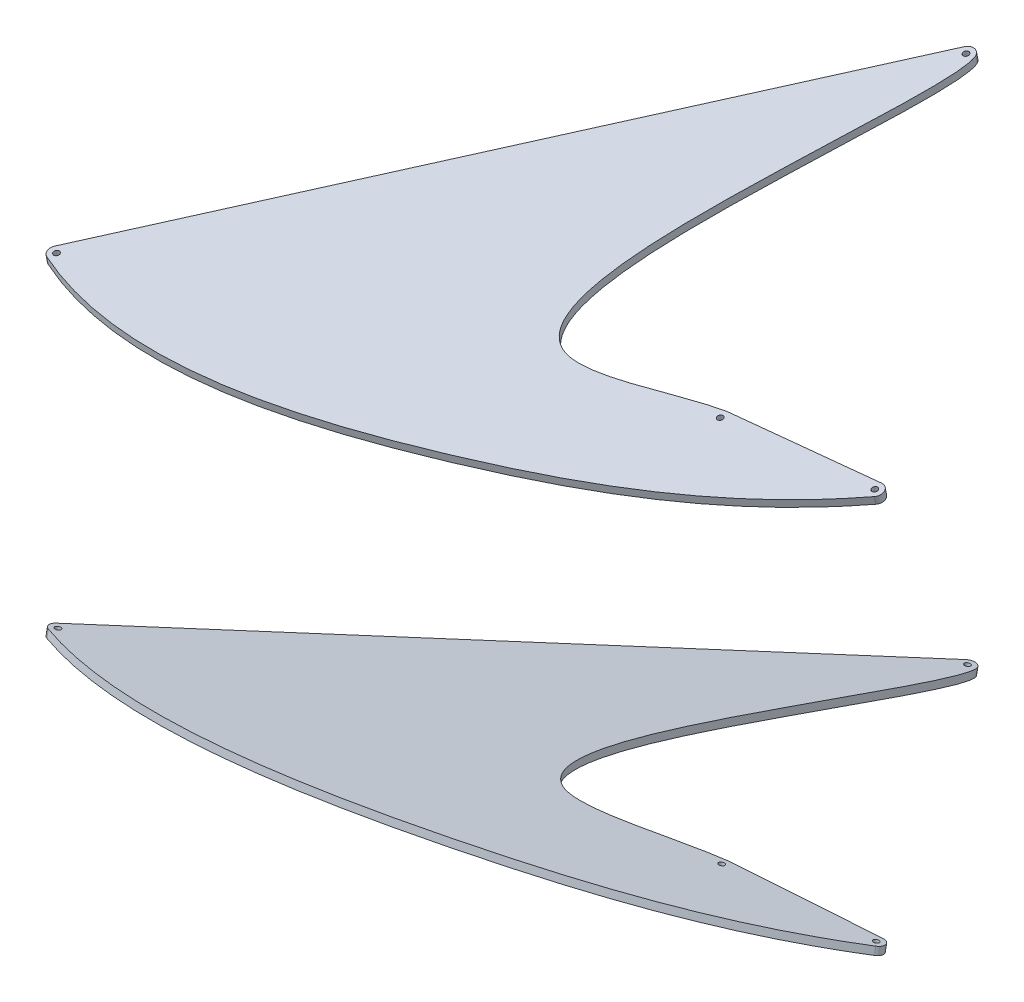
ISO-10303-21;
HEADER;
FILE_DESCRIPTION(('STEP AP214'),'2;1');
FILE_NAME('part.step','',(''),(''),'','','');
FILE_SCHEMA(('AUTOMOTIVE_DESIGN { 1 0 10303 214 1 1 1 1 }'));
ENDSEC;
DATA;
#1=APPLICATION_CONTEXT('core data for automotive mechanical design processes');
#2=APPLICATION_PROTOCOL_DEFINITION('international standard','automotive_design',2000,#1);
#3=PRODUCT_CONTEXT('',#1,'mechanical');
#4=PRODUCT('Part','Part','',(#3));
#5=PRODUCT_RELATED_PRODUCT_CATEGORY('part','',(#4));
#6=PRODUCT_DEFINITION_FORMATION('','',#4);
#7=PRODUCT_DEFINITION_CONTEXT('part definition',#1,'design');
#8=PRODUCT_DEFINITION('design','',#6,#7);
#9=PRODUCT_DEFINITION_SHAPE('','',#8);
#10=(LENGTH_UNIT() NAMED_UNIT(*) SI_UNIT(.MILLI.,.METRE.));
#11=(NAMED_UNIT(*) PLANE_ANGLE_UNIT() SI_UNIT($,.RADIAN.));
#12=(NAMED_UNIT(*) SI_UNIT($,.STERADIAN.) SOLID_ANGLE_UNIT());
#13=UNCERTAINTY_MEASURE_WITH_UNIT(LENGTH_MEASURE(1.E-05),#10,'distance_accuracy_value','');
#14=(GEOMETRIC_REPRESENTATION_CONTEXT(3) GLOBAL_UNCERTAINTY_ASSIGNED_CONTEXT((#13)) GLOBAL_UNIT_ASSIGNED_CONTEXT((#10,
#11,#12)) REPRESENTATION_CONTEXT('',''));
#15=CARTESIAN_POINT('',(0.,0.,0.));
#16=DIRECTION('',(0.,0.,1.));
#17=DIRECTION('',(1.,0.,0.));
#18=AXIS2_PLACEMENT_3D('',#15,#16,#17);
#19=CARTESIAN_POINT('',(85.8023522939303,179.336112250859,989.228940078294));
#20=DIRECTION('',(0.0912057377738218,-0.190013717008725,0.977535830926755));
#21=DIRECTION('',(0.,0.981627183447666,0.190808995376532));
#22=AXIS2_PLACEMENT_3D('',#19,#20,#21);
#23=PLANE('',#22);
#24=DIRECTION('',(-0.995832070882,-0.0174028751971982,0.0895300314851831));
#25=VECTOR('',#24,1.);
#26=CARTESIAN_POINT('',(85.8023522939303,187.18912971844,990.755412041306));
#27=LINE('',#26,#25);
#28=CARTESIAN_POINT('',(1634.87159887673,214.260218869266,851.486731633723));
#29=VERTEX_POINT('',#28);
#30=CARTESIAN_POINT('',(1483.17373169951,211.609190520854,865.12509017));
#31=VERTEX_POINT('',#30);
#32=EDGE_CURVE('E209',#29,#31,#27,.T.);
#33=ORIENTED_EDGE('',*,*,#32,.F.);
#34=DIRECTION('',(0.,0.981627183447666,0.190808995376532));
#35=VECTOR('',#34,1.);
#36=CARTESIAN_POINT('',(1634.87159887673,206.407201401685,849.960259670711));
#37=LINE('',#36,#35);
#38=CARTESIAN_POINT('',(1634.87159887673,206.407201401685,849.960259670711));
#39=VERTEX_POINT('',#38);
#40=EDGE_CURVE('E189',#39,#29,#37,.T.);
#41=ORIENTED_EDGE('',*,*,#40,.F.);
#42=DIRECTION('',(-0.995832070882,-0.0174028751971982,0.0895300314851831));
#43=VECTOR('',#42,1.);
#44=CARTESIAN_POINT('',(85.8023522939303,179.336112250859,989.228940078294));
#45=LINE('',#44,#43);
#46=CARTESIAN_POINT('',(1483.17373169951,203.756173053273,863.598618206988));
#47=VERTEX_POINT('',#46);
#48=EDGE_CURVE('E171',#39,#47,#45,.T.);
#49=ORIENTED_EDGE('',*,*,#48,.T.);
#50=DIRECTION('',(0.,0.981627183447666,0.190808995376532));
#51=VECTOR('',#50,1.);
#52=CARTESIAN_POINT('',(1483.17373169951,203.756173053273,863.598618206988));
#53=LINE('',#52,#51);
#54=EDGE_CURVE('E12',#47,#31,#53,.T.);
#55=ORIENTED_EDGE('',*,*,#54,.T.);
#56=EDGE_LOOP('',(#33,#41,#49,#55));
#57=FACE_BOUND('',#56,.T.);
#58=ADVANCED_FACE('F48',(#57),#23,.F.);
#59=CARTESIAN_POINT('',(1483.17373169951,203.756173053273,863.598618206988));
#60=CARTESIAN_POINT('',(1437.46975431813,202.285143875733,871.166407269909));
#61=CARTESIAN_POINT('',(1275.87917955866,188.154373527801,943.862918612124));
#62=CARTESIAN_POINT('',(1317.91374916909,239.794313006558,678.198460582201));
#63=CARTESIAN_POINT('',(1370.507425365,275.318540911062,495.442151251829));
#64=CARTESIAN_POINT('',(1362.28362897459,278.802568058359,477.51838539945));
#65=B_SPLINE_CURVE_WITH_KNOTS('',3,(#59,#60,#61,#62,#63,#64),.UNSPECIFIED.,.F.,.F.,(4,1,1,4),
(0.,0.258279360995668,0.641643028025611,1.),.UNSPECIFIED.);
#66=DIRECTION('',(0.,0.981627183447666,0.190808995376532));
#67=VECTOR('',#66,1.);
#68=SURFACE_OF_LINEAR_EXTRUSION('',#65,#67);
#69=CARTESIAN_POINT('',(1483.17373169951,211.609190520854,865.12509017));
#70=CARTESIAN_POINT('',(1437.46975431813,210.138161343315,872.692879232921));
#71=CARTESIAN_POINT('',(1275.87917955866,196.007390995382,945.389390575136));
#72=CARTESIAN_POINT('',(1317.91374916909,247.647330474139,679.724932545213));
#73=CARTESIAN_POINT('',(1370.507425365,283.171558378643,496.968623214842));
#74=CARTESIAN_POINT('',(1362.28362897459,286.65558552594,479.044857362463));
#75=B_SPLINE_CURVE_WITH_KNOTS('',3,(#69,#70,#71,#72,#73,#74),.UNSPECIFIED.,.F.,.F.,(4,1,1,4),
(0.,0.258279360995668,0.641643028025611,1.),.UNSPECIFIED.);
#76=CARTESIAN_POINT('',(1362.28362897459,286.65558552594,479.044857362463));
#77=VERTEX_POINT('',#76);
#78=EDGE_CURVE('E204',#31,#77,#75,.T.);
#79=ORIENTED_EDGE('',*,*,#78,.F.);
#80=ORIENTED_EDGE('',*,*,#54,.F.);
#81=CARTESIAN_POINT('',(1362.28362897459,278.802568058359,477.518385399451));
#82=VERTEX_POINT('',#81);
#83=EDGE_CURVE('E100',#47,#82,#65,.T.);
#84=ORIENTED_EDGE('',*,*,#83,.T.);
#85=DIRECTION('',(0.,0.981627183447666,0.190808995376532));
#86=VECTOR('',#85,1.);
#87=CARTESIAN_POINT('',(1362.28362897459,278.802568058359,477.518385399451));
#88=LINE('',#87,#86);
#89=EDGE_CURVE('E57',#82,#77,#88,.T.);
#90=ORIENTED_EDGE('',*,*,#89,.T.);
#91=EDGE_LOOP('',(#79,#80,#84,#90));
#92=FACE_BOUND('',#91,.T.);
#93=ADVANCED_FACE('F160',(#92),#68,.T.);
#94=CARTESIAN_POINT('',(1354.98932451009,278.175705406399,480.743314173053));
#95=DIRECTION('',(0.,0.981627183447666,0.190808995376532));
#96=DIRECTION('',(0.,0.190808995376532,-0.981627183447667));
#97=AXIS2_PLACEMENT_3D('',#94,#95,#96);
#98=CYLINDRICAL_SURFACE('',#97,7.99999999999995);
#99=CARTESIAN_POINT('',(1354.98932451009,286.02872287398,482.269786136065));
#100=DIRECTION('',(0.,0.981627183447667,0.190808995376532));
#101=DIRECTION('',(0.,-0.190808995376532,0.981627183447667));
#102=AXIS2_PLACEMENT_3D('',#99,#100,#101);
#103=CIRCLE('',#102,7.99999999999995);
#104=CARTESIAN_POINT('',(1348.4904984298,286.918908895785,477.690176062627));
#105=VERTEX_POINT('',#104);
#106=EDGE_CURVE('E202',#77,#105,#103,.T.);
#107=ORIENTED_EDGE('',*,*,#106,.F.);
#108=ORIENTED_EDGE('',*,*,#89,.F.);
#109=CARTESIAN_POINT('',(1354.98932451009,278.175705406399,480.743314173053));
#110=DIRECTION('',(0.,0.981627183447667,0.190808995376532));
#111=DIRECTION('',(0.,-0.190808995376532,0.981627183447667));
#112=AXIS2_PLACEMENT_3D('',#109,#110,#111);
#113=CIRCLE('',#112,7.99999999999995);
#114=CARTESIAN_POINT('',(1348.4904984298,279.065891428204,476.163704099615));
#115=VERTEX_POINT('',#114);
#116=EDGE_CURVE('E133',#82,#115,#113,.T.);
#117=ORIENTED_EDGE('',*,*,#116,.T.);
#118=DIRECTION('',(0.,0.981627183447666,0.190808995376532));
#119=VECTOR('',#118,1.);
#120=CARTESIAN_POINT('',(1348.4904984298,279.065891428204,476.163704099615));
#121=LINE('',#120,#119);
#122=EDGE_CURVE('E180',#115,#105,#121,.T.);
#123=ORIENTED_EDGE('',*,*,#122,.T.);
#124=EDGE_LOOP('',(#107,#108,#117,#123));
#125=FACE_BOUND('',#124,.T.);
#126=ADVANCED_FACE('F156',(#125),#98,.T.);
#127=CARTESIAN_POINT('',(1086.098920288,209.322714615042,834.96124446032));
#128=DIRECTION('',(-0.812353260036138,0.111273252725634,-0.572451259179781));
#129=DIRECTION('',(-0.576028483257774,0.,0.81742962172639));
#130=AXIS2_PLACEMENT_3D('',#127,#128,#129);
#131=PLANE('',#130);
#132=DIRECTION('',(0.583165654774576,0.155004309438346,-0.797428042613803));
#133=VECTOR('',#132,1.);
#134=CARTESIAN_POINT('',(1086.098920288,217.175732082623,836.487716423332));
#135=LINE('',#134,#133);
#136=CARTESIAN_POINT('',(939.371284339955,178.175808648449,1037.12492914916));
#137=VERTEX_POINT('',#136);
#138=EDGE_CURVE('E184',#137,#105,#135,.T.);
#139=ORIENTED_EDGE('',*,*,#138,.T.);
#140=ORIENTED_EDGE('',*,*,#122,.F.);
#141=DIRECTION('',(0.583165654774576,0.155004309438346,-0.797428042613803));
#142=VECTOR('',#141,1.);
#143=CARTESIAN_POINT('',(1086.098920288,209.322714615042,834.96124446032));
#144=LINE('',#143,#142);
#145=CARTESIAN_POINT('',(939.371284339955,170.322791180868,1035.59845718615));
#146=VERTEX_POINT('',#145);
#147=EDGE_CURVE('E131',#146,#115,#144,.T.);
#148=ORIENTED_EDGE('',*,*,#147,.F.);
#149=DIRECTION('',(0.,0.981627183447666,0.190808995376532));
#150=VECTOR('',#149,1.);
#151=CARTESIAN_POINT('',(939.371284339955,170.322791180868,1035.59845718615));
#152=LINE('',#151,#150);
#153=EDGE_CURVE('E125',#146,#137,#152,.T.);
#154=ORIENTED_EDGE('',*,*,#153,.T.);
#155=EDGE_LOOP('',(#139,#140,#148,#154));
#156=FACE_BOUND('',#155,.T.);
#157=ADVANCED_FACE('F153',(#156),#131,.T.);
#158=CARTESIAN_POINT('',(945.870110420244,169.432605159063,1040.17806725959));
#159=DIRECTION('',(0.,0.981627183447666,0.190808995376532));
#160=DIRECTION('',(0.,0.190808995376532,-0.981627183447667));
#161=AXIS2_PLACEMENT_3D('',#158,#159,#160);
#162=CYLINDRICAL_SURFACE('',#161,7.99999999999995);
#163=CARTESIAN_POINT('',(945.870110420244,177.285622626644,1041.7045392226));
#164=DIRECTION('',(0.,0.981627183447667,0.190808995376532));
#165=DIRECTION('',(0.,-0.190808995376532,0.981627183447667));
#166=AXIS2_PLACEMENT_3D('',#163,#164,#165);
#167=CIRCLE('',#166,7.99999999999995);
#168=CARTESIAN_POINT('',(942.811265429459,175.875139258519,1048.96084709855));
#169=VERTEX_POINT('',#168);
#170=EDGE_CURVE('E196',#137,#169,#167,.T.);
#171=ORIENTED_EDGE('',*,*,#170,.F.);
#172=ORIENTED_EDGE('',*,*,#153,.F.);
#173=CARTESIAN_POINT('',(945.870110420244,169.432605159063,1040.17806725959));
#174=DIRECTION('',(0.,0.981627183447667,0.190808995376532));
#175=DIRECTION('',(0.,-0.190808995376532,0.981627183447667));
#176=AXIS2_PLACEMENT_3D('',#173,#174,#175);
#177=CIRCLE('',#176,7.99999999999995);
#178=CARTESIAN_POINT('',(942.811265429459,168.022121790937,1047.43437513554));
#179=VERTEX_POINT('',#178);
#180=EDGE_CURVE('E115',#146,#179,#177,.T.);
#181=ORIENTED_EDGE('',*,*,#180,.T.);
#182=DIRECTION('',(0.,0.981627183447666,0.190808995376532));
#183=VECTOR('',#182,1.);
#184=CARTESIAN_POINT('',(942.811265429459,168.022121790937,1047.43437513554));
#185=LINE('',#184,#183);
#186=EDGE_CURVE('E120',#179,#169,#185,.T.);
#187=ORIENTED_EDGE('',*,*,#186,.T.);
#188=EDGE_LOOP('',(#171,#172,#181,#187));
#189=FACE_BOUND('',#188,.T.);
#190=ADVANCED_FACE('F128',(#189),#162,.T.);
#191=CARTESIAN_POINT('',(942.811265429459,168.022121790937,1047.43437513554));
#192=CARTESIAN_POINT('',(1065.43063585139,158.340541049026,1097.24179022229));
#193=CARTESIAN_POINT('',(1335.8064137837,170.009935627326,1037.20795948054));
#194=CARTESIAN_POINT('',(1556.49988429373,189.082458388016,939.088335917341));
#195=CARTESIAN_POINT('',(1640.28133100087,203.756173053273,863.598618206988));
#196=B_SPLINE_CURVE_WITH_KNOTS('',3,(#191,#192,#193,#194,#195),.UNSPECIFIED.,.F.,.F.,(4,1,4),
(0.,0.548324658818847,1.),.UNSPECIFIED.);
#197=DIRECTION('',(0.,0.981627183447666,0.190808995376532));
#198=VECTOR('',#197,1.);
#199=SURFACE_OF_LINEAR_EXTRUSION('',#196,#198);
#200=CARTESIAN_POINT('',(942.811265429459,175.875139258519,1048.96084709855));
#201=CARTESIAN_POINT('',(1065.43063585139,166.193558516607,1098.7682621853));
#202=CARTESIAN_POINT('',(1335.8064137837,177.862953094908,1038.73443144355));
#203=CARTESIAN_POINT('',(1556.49988429373,196.935475855598,940.614807880353));
#204=CARTESIAN_POINT('',(1640.28133100087,211.609190520854,865.12509017));
#205=B_SPLINE_CURVE_WITH_KNOTS('',3,(#200,#201,#202,#203,#204),.UNSPECIFIED.,.F.,.F.,(4,1,4),
(0.,0.548324658818847,1.),.UNSPECIFIED.);
#206=CARTESIAN_POINT('',(1640.28133100087,211.609190520854,865.12509017));
#207=VERTEX_POINT('',#206);
#208=EDGE_CURVE('E122',#169,#207,#205,.T.);
#209=ORIENTED_EDGE('',*,*,#208,.F.);
#210=ORIENTED_EDGE('',*,*,#186,.F.);
#211=CARTESIAN_POINT('',(1640.28133100087,203.756173053273,863.598618206988));
#212=VERTEX_POINT('',#211);
#213=EDGE_CURVE('E111',#179,#212,#196,.T.);
#214=ORIENTED_EDGE('',*,*,#213,.T.);
#215=DIRECTION('',(0.,0.981627183447666,0.190808995376532));
#216=VECTOR('',#215,1.);
#217=CARTESIAN_POINT('',(1640.28133100087,203.756173053273,863.598618206988));
#218=LINE('',#217,#216);
#219=EDGE_CURVE('E126',#212,#207,#218,.T.);
#220=ORIENTED_EDGE('',*,*,#219,.T.);
#221=EDGE_LOOP('',(#209,#210,#214,#220));
#222=FACE_BOUND('',#221,.T.);
#223=ADVANCED_FACE('F121',(#222),#199,.T.);
#224=CARTESIAN_POINT('',(1354.98932451009,278.175705406399,480.743314173053));
#225=DIRECTION('',(0.,0.981627183447666,0.190808995376532));
#226=DIRECTION('',(0.,0.190808995376532,-0.981627183447667));
#227=AXIS2_PLACEMENT_3D('',#224,#225,#226);
#228=CYLINDRICAL_SURFACE('',#227,2.99999999999993);
#229=CARTESIAN_POINT('',(1354.98932451009,278.175705406399,480.743314173053));
#230=DIRECTION('',(0.,0.981627183447667,0.190808995376532));
#231=DIRECTION('',(0.,-0.190808995376532,0.981627183447667));
#232=AXIS2_PLACEMENT_3D('',#229,#230,#231);
#233=CIRCLE('',#232,2.99999999999993);
#234=CARTESIAN_POINT('',(1354.98932451009,277.603278420269,483.688195723395));
#235=VERTEX_POINT('',#234);
#236=EDGE_CURVE('E239',#235,#235,#233,.T.);
#237=ORIENTED_EDGE('',*,*,#236,.F.);
#238=EDGE_LOOP('',(#237));
#239=FACE_BOUND('',#238,.T.);
#240=CARTESIAN_POINT('',(1354.98932451009,286.02872287398,482.269786136065));
#241=DIRECTION('',(0.,0.981627183447667,0.190808995376532));
#242=DIRECTION('',(0.,-0.190808995376532,0.981627183447667));
#243=AXIS2_PLACEMENT_3D('',#240,#241,#242);
#244=CIRCLE('',#243,2.99999999999993);
#245=CARTESIAN_POINT('',(1354.98932451009,285.456295887851,485.214667686408));
#246=VERTEX_POINT('',#245);
#247=EDGE_CURVE('E214',#246,#246,#244,.T.);
#248=ORIENTED_EDGE('',*,*,#247,.T.);
#249=EDGE_LOOP('',(#248));
#250=FACE_BOUND('',#249,.T.);
#251=ADVANCED_FACE('F148',(#239,#250),#228,.F.);
#252=CARTESIAN_POINT('',(945.870110420244,169.432605159063,1040.17806725959));
#253=DIRECTION('',(0.,0.981627183447666,0.190808995376532));
#254=DIRECTION('',(0.,0.190808995376532,-0.981627183447667));
#255=AXIS2_PLACEMENT_3D('',#252,#253,#254);
#256=CYLINDRICAL_SURFACE('',#255,3.00000000000004);
#257=CARTESIAN_POINT('',(945.870110420244,169.432605159063,1040.17806725959));
#258=DIRECTION('',(0.,0.981627183447667,0.190808995376532));
#259=DIRECTION('',(0.,-0.190808995376532,0.981627183447667));
#260=AXIS2_PLACEMENT_3D('',#257,#258,#259);
#261=CIRCLE('',#260,3.00000000000004);
#262=CARTESIAN_POINT('',(945.870110420244,168.860178172933,1043.12294880993));
#263=VERTEX_POINT('',#262);
#264=EDGE_CURVE('E241',#263,#263,#261,.T.);
#265=ORIENTED_EDGE('',*,*,#264,.F.);
#266=EDGE_LOOP('',(#265));
#267=FACE_BOUND('',#266,.T.);
#268=CARTESIAN_POINT('',(945.870110420244,177.285622626644,1041.7045392226));
#269=DIRECTION('',(0.,0.981627183447667,0.190808995376532));
#270=DIRECTION('',(0.,-0.190808995376532,0.981627183447667));
#271=AXIS2_PLACEMENT_3D('',#268,#269,#270);
#272=CIRCLE('',#271,3.00000000000004);
#273=CARTESIAN_POINT('',(945.870110420244,176.713195640515,1044.64942077294));
#274=VERTEX_POINT('',#273);
#275=EDGE_CURVE('E217',#274,#274,#272,.T.);
#276=ORIENTED_EDGE('',*,*,#275,.T.);
#277=EDGE_LOOP('',(#276));
#278=FACE_BOUND('',#277,.T.);
#279=ADVANCED_FACE('F261',(#267,#278),#256,.F.);
#280=CARTESIAN_POINT('',(1634.87159887673,204.880729438673,857.813277138292));
#281=DIRECTION('',(0.,0.981627183447666,0.190808995376532));
#282=DIRECTION('',(0.,0.190808995376532,-0.981627183447667));
#283=AXIS2_PLACEMENT_3D('',#280,#281,#282);
#284=CYLINDRICAL_SURFACE('',#283,2.99999999607766);
#285=CARTESIAN_POINT('',(1634.87159887673,204.880729438673,857.813277138292));
#286=DIRECTION('',(0.,0.981627183447667,0.190808995376532));
#287=DIRECTION('',(0.,-0.190808995376532,0.981627183447667));
#288=AXIS2_PLACEMENT_3D('',#285,#286,#287);
#289=CIRCLE('',#288,2.99999999607766);
#290=CARTESIAN_POINT('',(1634.87159887673,204.308302453292,860.758158684785));
#291=VERTEX_POINT('',#290);
#292=EDGE_CURVE('E245',#291,#291,#289,.T.);
#293=ORIENTED_EDGE('',*,*,#292,.F.);
#294=EDGE_LOOP('',(#293));
#295=FACE_BOUND('',#294,.T.);
#296=CARTESIAN_POINT('',(1634.87159887673,212.733746906254,859.339749101305));
#297=DIRECTION('',(0.,0.981627183447667,0.190808995376532));
#298=DIRECTION('',(0.,-0.190808995376532,0.981627183447667));
#299=AXIS2_PLACEMENT_3D('',#296,#297,#298);
#300=CIRCLE('',#299,2.99999999607766);
#301=CARTESIAN_POINT('',(1634.87159887673,212.161319920873,862.284630647797));
#302=VERTEX_POINT('',#301);
#303=EDGE_CURVE('E220',#302,#302,#300,.T.);
#304=ORIENTED_EDGE('',*,*,#303,.T.);
#305=EDGE_LOOP('',(#304));
#306=FACE_BOUND('',#305,.T.);
#307=ADVANCED_FACE('F256',(#295,#306),#284,.F.);
#308=CARTESIAN_POINT('',(1483.9033776017,202.236063317203,871.418904854402));
#309=DIRECTION('',(0.,0.981627183447666,0.190808995376532));
#310=DIRECTION('',(0.,0.190808995376532,-0.981627183447667));
#311=AXIS2_PLACEMENT_3D('',#308,#309,#310);
#312=CYLINDRICAL_SURFACE('',#311,2.9999999998645);
#313=CARTESIAN_POINT('',(1483.9033776017,202.236063317203,871.418904854402));
#314=DIRECTION('',(0.,0.981627183447667,0.190808995376532));
#315=DIRECTION('',(0.,-0.190808995376532,0.981627183447667));
#316=AXIS2_PLACEMENT_3D('',#313,#314,#315);
#317=CIRCLE('',#316,2.9999999998645);
#318=CARTESIAN_POINT('',(1483.9033776017,201.663636331099,874.363786404612));
#319=VERTEX_POINT('',#318);
#320=EDGE_CURVE('E192',#319,#319,#317,.T.);
#321=ORIENTED_EDGE('',*,*,#320,.F.);
#322=EDGE_LOOP('',(#321));
#323=FACE_BOUND('',#322,.T.);
#324=CARTESIAN_POINT('',(1483.9033776017,210.089080784784,872.945376817414));
#325=DIRECTION('',(0.,0.981627183447667,0.190808995376532));
#326=DIRECTION('',(0.,-0.190808995376532,0.981627183447667));
#327=AXIS2_PLACEMENT_3D('',#324,#325,#326);
#328=CIRCLE('',#327,2.9999999998645);
#329=CARTESIAN_POINT('',(1483.9033776017,209.51665379868,875.890258367624));
#330=VERTEX_POINT('',#329);
#331=EDGE_CURVE('E222',#330,#330,#328,.T.);
#332=ORIENTED_EDGE('',*,*,#331,.T.);
#333=EDGE_LOOP('',(#332));
#334=FACE_BOUND('',#333,.T.);
#335=ADVANCED_FACE('F50',(#323,#334),#312,.F.);
#336=CARTESIAN_POINT('',(1634.87159887673,204.880729438673,857.813277138292));
#337=DIRECTION('',(0.,0.981627183447666,0.190808995376532));
#338=DIRECTION('',(0.,0.190808995376532,-0.981627183447667));
#339=AXIS2_PLACEMENT_3D('',#336,#337,#338);
#340=CYLINDRICAL_SURFACE('',#339,7.99999999999998);
#341=CARTESIAN_POINT('',(1634.87159887673,212.733746906254,859.339749101305));
#342=DIRECTION('',(0.,0.981627183447667,0.190808995376532));
#343=DIRECTION('',(0.,-0.190808995376532,0.981627183447667));
#344=AXIS2_PLACEMENT_3D('',#341,#342,#343);
#345=CIRCLE('',#344,7.99999999999998);
#346=EDGE_CURVE('E88',#207,#29,#345,.T.);
#347=ORIENTED_EDGE('',*,*,#346,.F.);
#348=ORIENTED_EDGE('',*,*,#219,.F.);
#349=CARTESIAN_POINT('',(1634.87159887673,204.880729438673,857.813277138292));
#350=DIRECTION('',(0.,0.981627183447667,0.190808995376532));
#351=DIRECTION('',(0.,-0.190808995376532,0.981627183447667));
#352=AXIS2_PLACEMENT_3D('',#349,#350,#351);
#353=CIRCLE('',#352,7.99999999999998);
#354=EDGE_CURVE('E65',#212,#39,#353,.T.);
#355=ORIENTED_EDGE('',*,*,#354,.T.);
#356=ORIENTED_EDGE('',*,*,#40,.T.);
#357=EDGE_LOOP('',(#347,#348,#355,#356));
#358=FACE_BOUND('',#357,.T.);
#359=ADVANCED_FACE('F149',(#358),#340,.T.);
#360=CARTESIAN_POINT('',(0.,358.092671710886,69.6061642271087));
#361=DIRECTION('',(0.,-0.981627183447667,-0.190808995376532));
#362=DIRECTION('',(0.,-0.190808995376532,0.981627183447667));
#363=AXIS2_PLACEMENT_3D('',#360,#361,#362);
#364=PLANE('',#363);
#365=ORIENTED_EDGE('',*,*,#320,.T.);
#366=EDGE_LOOP('',(#365));
#367=FACE_BOUND('',#366,.T.);
#368=ORIENTED_EDGE('',*,*,#292,.T.);
#369=EDGE_LOOP('',(#368));
#370=FACE_BOUND('',#369,.T.);
#371=ORIENTED_EDGE('',*,*,#264,.T.);
#372=EDGE_LOOP('',(#371));
#373=FACE_BOUND('',#372,.T.);
#374=ORIENTED_EDGE('',*,*,#236,.T.);
#375=EDGE_LOOP('',(#374));
#376=FACE_BOUND('',#375,.T.);
#377=ORIENTED_EDGE('',*,*,#48,.F.);
#378=ORIENTED_EDGE('',*,*,#354,.F.);
#379=ORIENTED_EDGE('',*,*,#213,.F.);
#380=ORIENTED_EDGE('',*,*,#180,.F.);
#381=ORIENTED_EDGE('',*,*,#147,.T.);
#382=ORIENTED_EDGE('',*,*,#116,.F.);
#383=ORIENTED_EDGE('',*,*,#83,.F.);
#384=EDGE_LOOP('',(#377,#378,#379,#380,#381,#382,#383));
#385=FACE_BOUND('',#384,.T.);
#386=ADVANCED_FACE('F113',(#367,#370,#373,#376,#385),#364,.T.);
#387=CARTESIAN_POINT('',(0.,365.945689178468,71.1326361901209));
#388=DIRECTION('',(0.,-0.981627183447667,-0.190808995376532));
#389=DIRECTION('',(0.,-0.190808995376532,0.981627183447667));
#390=AXIS2_PLACEMENT_3D('',#387,#388,#389);
#391=PLANE('',#390);
#392=ORIENTED_EDGE('',*,*,#331,.F.);
#393=EDGE_LOOP('',(#392));
#394=FACE_BOUND('',#393,.T.);
#395=ORIENTED_EDGE('',*,*,#303,.F.);
#396=EDGE_LOOP('',(#395));
#397=FACE_BOUND('',#396,.T.);
#398=ORIENTED_EDGE('',*,*,#275,.F.);
#399=EDGE_LOOP('',(#398));
#400=FACE_BOUND('',#399,.T.);
#401=ORIENTED_EDGE('',*,*,#247,.F.);
#402=EDGE_LOOP('',(#401));
#403=FACE_BOUND('',#402,.T.);
#404=ORIENTED_EDGE('',*,*,#32,.T.);
#405=ORIENTED_EDGE('',*,*,#78,.T.);
#406=ORIENTED_EDGE('',*,*,#106,.T.);
#407=ORIENTED_EDGE('',*,*,#138,.F.);
#408=ORIENTED_EDGE('',*,*,#170,.T.);
#409=ORIENTED_EDGE('',*,*,#208,.T.);
#410=ORIENTED_EDGE('',*,*,#346,.T.);
#411=EDGE_LOOP('',(#404,#405,#406,#407,#408,#409,#410));
#412=FACE_BOUND('',#411,.T.);
#413=ADVANCED_FACE('F227',(#394,#397,#400,#403,#412),#391,.F.);
#414=CLOSED_SHELL('',(#58,#93,#126,#157,#190,#223,#251,#279,#307,#335,#359,#386,#413));
#415=MANIFOLD_SOLID_BREP('B2',#414);
#416=CARTESIAN_POINT('',(85.8023522939303,-179.336112250859,989.228940078294));
#417=DIRECTION('',(0.0912057377738218,0.190013717008725,0.977535830926755));
#418=DIRECTION('',(0.,-0.981627183447666,0.190808995376532));
#419=AXIS2_PLACEMENT_3D('',#416,#417,#418);
#420=PLANE('',#419);
#421=DIRECTION('',(-0.995832070882,0.0174028751971982,0.0895300314851831));
#422=VECTOR('',#421,1.);
#423=CARTESIAN_POINT('',(85.8023522939303,-187.18912971844,990.755412041306));
#424=LINE('',#423,#422);
#425=CARTESIAN_POINT('',(1634.87159887673,-214.260218869266,851.486731633723));
#426=VERTEX_POINT('',#425);
#427=CARTESIAN_POINT('',(1483.17373169951,-211.609190520854,865.12509017));
#428=VERTEX_POINT('',#427);
#429=EDGE_CURVE('E503',#426,#428,#424,.T.);
#430=ORIENTED_EDGE('',*,*,#429,.T.);
#431=DIRECTION('',(0.,-0.981627183447666,0.190808995376532));
#432=VECTOR('',#431,1.);
#433=CARTESIAN_POINT('',(1483.17373169951,-203.756173053273,863.598618206988));
#434=LINE('',#433,#432);
#435=CARTESIAN_POINT('',(1483.17373169951,-203.756173053273,863.598618206988));
#436=VERTEX_POINT('',#435);
#437=EDGE_CURVE('E46',#436,#428,#434,.T.);
#438=ORIENTED_EDGE('',*,*,#437,.F.);
#439=DIRECTION('',(-0.995832070882,0.0174028751971982,0.0895300314851831));
#440=VECTOR('',#439,1.);
#441=CARTESIAN_POINT('',(85.8023522939303,-179.336112250859,989.228940078294));
#442=LINE('',#441,#440);
#443=CARTESIAN_POINT('',(1634.87159887673,-206.407201401685,849.960259670711));
#444=VERTEX_POINT('',#443);
#445=EDGE_CURVE('E479',#444,#436,#442,.T.);
#446=ORIENTED_EDGE('',*,*,#445,.F.);
#447=DIRECTION('',(0.,-0.981627183447666,0.190808995376532));
#448=VECTOR('',#447,1.);
#449=CARTESIAN_POINT('',(1634.87159887673,-206.407201401685,849.960259670711));
#450=LINE('',#449,#448);
#451=EDGE_CURVE('E441',#444,#426,#450,.T.);
#452=ORIENTED_EDGE('',*,*,#451,.T.);
#453=EDGE_LOOP('',(#430,#438,#446,#452));
#454=FACE_BOUND('',#453,.T.);
#455=ADVANCED_FACE('F355',(#454),#420,.F.);
#456=CARTESIAN_POINT('',(1483.17373169951,-203.756173053273,863.598618206988));
#457=CARTESIAN_POINT('',(1437.46975431813,-202.285143875733,871.166407269909));
#458=CARTESIAN_POINT('',(1275.87917955866,-188.154373527801,943.862918612124));
#459=CARTESIAN_POINT('',(1317.91374916909,-239.794313006558,678.198460582201));
#460=CARTESIAN_POINT('',(1370.507425365,-275.318540911062,495.442151251829));
#461=CARTESIAN_POINT('',(1362.28362897459,-278.802568058359,477.51838539945));
#462=B_SPLINE_CURVE_WITH_KNOTS('',3,(#456,#457,#458,#459,#460,#461),.UNSPECIFIED.,.F.,.F.,(4,1,
1,4),(0.,0.258279360995668,0.641643028025611,1.),.UNSPECIFIED.);
#463=DIRECTION('',(0.,-0.981627183447666,0.190808995376532));
#464=VECTOR('',#463,1.);
#465=SURFACE_OF_LINEAR_EXTRUSION('',#462,#464);
#466=CARTESIAN_POINT('',(1483.17373169951,-211.609190520854,865.12509017));
#467=CARTESIAN_POINT('',(1437.46975431813,-210.138161343315,872.692879232921));
#468=CARTESIAN_POINT('',(1275.87917955866,-196.007390995382,945.389390575136));
#469=CARTESIAN_POINT('',(1317.91374916909,-247.647330474139,679.724932545213));
#470=CARTESIAN_POINT('',(1370.507425365,-283.171558378643,496.968623214842));
#471=CARTESIAN_POINT('',(1362.28362897459,-286.65558552594,479.044857362463));
#472=B_SPLINE_CURVE_WITH_KNOTS('',3,(#466,#467,#468,#469,#470,#471),.UNSPECIFIED.,.F.,.F.,(4,1,
1,4),(0.,0.258279360995668,0.641643028025611,1.),.UNSPECIFIED.);
#473=CARTESIAN_POINT('',(1362.28362897459,-286.65558552594,479.044857362463));
#474=VERTEX_POINT('',#473);
#475=EDGE_CURVE('E500',#428,#474,#472,.T.);
#476=ORIENTED_EDGE('',*,*,#475,.T.);
#477=DIRECTION('',(0.,-0.981627183447666,0.190808995376532));
#478=VECTOR('',#477,1.);
#479=CARTESIAN_POINT('',(1362.28362897459,-278.802568058359,477.518385399451));
#480=LINE('',#479,#478);
#481=CARTESIAN_POINT('',(1362.28362897459,-278.802568058359,477.518385399451));
#482=VERTEX_POINT('',#481);
#483=EDGE_CURVE('E364',#482,#474,#480,.T.);
#484=ORIENTED_EDGE('',*,*,#483,.F.);
#485=EDGE_CURVE('E412',#436,#482,#462,.T.);
#486=ORIENTED_EDGE('',*,*,#485,.F.);
#487=ORIENTED_EDGE('',*,*,#437,.T.);
#488=EDGE_LOOP('',(#476,#484,#486,#487));
#489=FACE_BOUND('',#488,.T.);
#490=ADVANCED_FACE('F467',(#489),#465,.F.);
#491=CARTESIAN_POINT('',(1354.98932451009,-278.175705406399,480.743314173053));
#492=DIRECTION('',(0.,-0.981627183447666,0.190808995376532));
#493=DIRECTION('',(0.,-0.190808995376532,-0.981627183447667));
#494=AXIS2_PLACEMENT_3D('',#491,#492,#493);
#495=CYLINDRICAL_SURFACE('',#494,7.99999999999995);
#496=CARTESIAN_POINT('',(1354.98932451009,-286.02872287398,482.269786136065));
#497=DIRECTION('',(0.,0.981627183447667,-0.190808995376532));
#498=DIRECTION('',(0.,0.190808995376532,0.981627183447667));
#499=AXIS2_PLACEMENT_3D('',#496,#497,#498);
#500=CIRCLE('',#499,7.99999999999995);
#501=CARTESIAN_POINT('',(1348.4904984298,-286.918908895785,477.690176062627));
#502=VERTEX_POINT('',#501);
#503=EDGE_CURVE('E496',#474,#502,#500,.T.);
#504=ORIENTED_EDGE('',*,*,#503,.T.);
#505=DIRECTION('',(0.,-0.981627183447666,0.190808995376532));
#506=VECTOR('',#505,1.);
#507=CARTESIAN_POINT('',(1348.4904984298,-279.065891428204,476.163704099615));
#508=LINE('',#507,#506);
#509=CARTESIAN_POINT('',(1348.4904984298,-279.065891428204,476.163704099615));
#510=VERTEX_POINT('',#509);
#511=EDGE_CURVE('E486',#510,#502,#508,.T.);
#512=ORIENTED_EDGE('',*,*,#511,.F.);
#513=CARTESIAN_POINT('',(1354.98932451009,-278.175705406399,480.743314173053));
#514=DIRECTION('',(0.,0.981627183447667,-0.190808995376532));
#515=DIRECTION('',(0.,0.190808995376532,0.981627183447667));
#516=AXIS2_PLACEMENT_3D('',#513,#514,#515);
#517=CIRCLE('',#516,7.99999999999995);
#518=EDGE_CURVE('E478',#482,#510,#517,.T.);
#519=ORIENTED_EDGE('',*,*,#518,.F.);
#520=ORIENTED_EDGE('',*,*,#483,.T.);
#521=EDGE_LOOP('',(#504,#512,#519,#520));
#522=FACE_BOUND('',#521,.T.);
#523=ADVANCED_FACE('F463',(#522),#495,.T.);
#524=CARTESIAN_POINT('',(1086.098920288,-209.322714615042,834.96124446032));
#525=DIRECTION('',(-0.812353260036138,-0.111273252725634,-0.572451259179781));
#526=DIRECTION('',(-0.576028483257774,0.,0.81742962172639));
#527=AXIS2_PLACEMENT_3D('',#524,#525,#526);
#528=PLANE('',#527);
#529=DIRECTION('',(0.583165654774576,-0.155004309438346,-0.797428042613803));
#530=VECTOR('',#529,1.);
#531=CARTESIAN_POINT('',(1086.098920288,-217.175732082623,836.487716423332));
#532=LINE('',#531,#530);
#533=CARTESIAN_POINT('',(939.371284339955,-178.175808648449,1037.12492914916));
#534=VERTEX_POINT('',#533);
#535=EDGE_CURVE('E489',#534,#502,#532,.T.);
#536=ORIENTED_EDGE('',*,*,#535,.F.);
#537=DIRECTION('',(0.,-0.981627183447666,0.190808995376532));
#538=VECTOR('',#537,1.);
#539=CARTESIAN_POINT('',(939.371284339955,-170.322791180868,1035.59845718615));
#540=LINE('',#539,#538);
#541=CARTESIAN_POINT('',(939.371284339955,-170.322791180868,1035.59845718615));
#542=VERTEX_POINT('',#541);
#543=EDGE_CURVE('E436',#542,#534,#540,.T.);
#544=ORIENTED_EDGE('',*,*,#543,.F.);
#545=DIRECTION('',(0.583165654774576,-0.155004309438346,-0.797428042613803));
#546=VECTOR('',#545,1.);
#547=CARTESIAN_POINT('',(1086.098920288,-209.322714615042,834.96124446032));
#548=LINE('',#547,#546);
#549=EDGE_CURVE('E429',#542,#510,#548,.T.);
#550=ORIENTED_EDGE('',*,*,#549,.T.);
#551=ORIENTED_EDGE('',*,*,#511,.T.);
#552=EDGE_LOOP('',(#536,#544,#550,#551));
#553=FACE_BOUND('',#552,.T.);
#554=ADVANCED_FACE('F460',(#553),#528,.T.);
#555=CARTESIAN_POINT('',(945.870110420244,-169.432605159063,1040.17806725959));
#556=DIRECTION('',(0.,-0.981627183447666,0.190808995376532));
#557=DIRECTION('',(0.,-0.190808995376532,-0.981627183447667));
#558=AXIS2_PLACEMENT_3D('',#555,#556,#557);
#559=CYLINDRICAL_SURFACE('',#558,7.99999999999995);
#560=CARTESIAN_POINT('',(945.870110420244,-177.285622626644,1041.7045392226));
#561=DIRECTION('',(0.,0.981627183447667,-0.190808995376532));
#562=DIRECTION('',(0.,0.190808995376532,0.981627183447667));
#563=AXIS2_PLACEMENT_3D('',#560,#561,#562);
#564=CIRCLE('',#563,7.99999999999995);
#565=CARTESIAN_POINT('',(942.811265429459,-175.875139258519,1048.96084709855));
#566=VERTEX_POINT('',#565);
#567=EDGE_CURVE('E435',#534,#566,#564,.T.);
#568=ORIENTED_EDGE('',*,*,#567,.T.);
#569=DIRECTION('',(0.,-0.981627183447666,0.190808995376532));
#570=VECTOR('',#569,1.);
#571=CARTESIAN_POINT('',(942.811265429459,-168.022121790937,1047.43437513554));
#572=LINE('',#571,#570);
#573=CARTESIAN_POINT('',(942.811265429459,-168.022121790937,1047.43437513554));
#574=VERTEX_POINT('',#573);
#575=EDGE_CURVE('E432',#574,#566,#572,.T.);
#576=ORIENTED_EDGE('',*,*,#575,.F.);
#577=CARTESIAN_POINT('',(945.870110420244,-169.432605159063,1040.17806725959));
#578=DIRECTION('',(0.,0.981627183447667,-0.190808995376532));
#579=DIRECTION('',(0.,0.190808995376532,0.981627183447667));
#580=AXIS2_PLACEMENT_3D('',#577,#578,#579);
#581=CIRCLE('',#580,7.99999999999995);
#582=EDGE_CURVE('E423',#542,#574,#581,.T.);
#583=ORIENTED_EDGE('',*,*,#582,.F.);
#584=ORIENTED_EDGE('',*,*,#543,.T.);
#585=EDGE_LOOP('',(#568,#576,#583,#584));
#586=FACE_BOUND('',#585,.T.);
#587=ADVANCED_FACE('F433',(#586),#559,.T.);
#588=CARTESIAN_POINT('',(942.811265429459,-168.022121790937,1047.43437513554));
#589=CARTESIAN_POINT('',(1065.43063585139,-158.340541049026,1097.24179022229));
#590=CARTESIAN_POINT('',(1335.8064137837,-170.009935627326,1037.20795948054));
#591=CARTESIAN_POINT('',(1556.49988429373,-189.082458388016,939.088335917341));
#592=CARTESIAN_POINT('',(1640.28133100087,-203.756173053273,863.598618206988));
#593=B_SPLINE_CURVE_WITH_KNOTS('',3,(#588,#589,#590,#591,#592),.UNSPECIFIED.,.F.,.F.,(4,1,4),
(0.,0.548324658818847,1.),.UNSPECIFIED.);
#594=DIRECTION('',(0.,-0.981627183447666,0.190808995376532));
#595=VECTOR('',#594,1.);
#596=SURFACE_OF_LINEAR_EXTRUSION('',#593,#595);
#597=CARTESIAN_POINT('',(942.811265429459,-175.875139258519,1048.96084709855));
#598=CARTESIAN_POINT('',(1065.43063585139,-166.193558516607,1098.7682621853));
#599=CARTESIAN_POINT('',(1335.8064137837,-177.862953094908,1038.73443144355));
#600=CARTESIAN_POINT('',(1556.49988429373,-196.935475855598,940.614807880353));
#601=CARTESIAN_POINT('',(1640.28133100087,-211.609190520854,865.12509017));
#602=B_SPLINE_CURVE_WITH_KNOTS('',3,(#597,#598,#599,#600,#601),.UNSPECIFIED.,.F.,.F.,(4,1,4),
(0.,0.548324658818847,1.),.UNSPECIFIED.);
#603=CARTESIAN_POINT('',(1640.28133100087,-211.609190520854,865.12509017));
#604=VERTEX_POINT('',#603);
#605=EDGE_CURVE('E398',#566,#604,#602,.T.);
#606=ORIENTED_EDGE('',*,*,#605,.T.);
#607=DIRECTION('',(0.,-0.981627183447666,0.190808995376532));
#608=VECTOR('',#607,1.);
#609=CARTESIAN_POINT('',(1640.28133100087,-203.756173053273,863.598618206988));
#610=LINE('',#609,#608);
#611=CARTESIAN_POINT('',(1640.28133100087,-203.756173053273,863.598618206988));
#612=VERTEX_POINT('',#611);
#613=EDGE_CURVE('E437',#612,#604,#610,.T.);
#614=ORIENTED_EDGE('',*,*,#613,.F.);
#615=EDGE_CURVE('E427',#574,#612,#593,.T.);
#616=ORIENTED_EDGE('',*,*,#615,.F.);
#617=ORIENTED_EDGE('',*,*,#575,.T.);
#618=EDGE_LOOP('',(#606,#614,#616,#617));
#619=FACE_BOUND('',#618,.T.);
#620=ADVANCED_FACE('F439',(#619),#596,.F.);
#621=CARTESIAN_POINT('',(1354.98932451009,-278.175705406399,480.743314173053));
#622=DIRECTION('',(0.,-0.981627183447666,0.190808995376532));
#623=DIRECTION('',(0.,-0.190808995376532,-0.981627183447667));
#624=AXIS2_PLACEMENT_3D('',#621,#622,#623);
#625=CYLINDRICAL_SURFACE('',#624,2.99999999999993);
#626=CARTESIAN_POINT('',(1354.98932451009,-278.175705406399,480.743314173053));
#627=DIRECTION('',(0.,0.981627183447667,-0.190808995376532));
#628=DIRECTION('',(0.,0.190808995376532,0.981627183447667));
#629=AXIS2_PLACEMENT_3D('',#626,#627,#628);
#630=CIRCLE('',#629,2.99999999999993);
#631=CARTESIAN_POINT('',(1354.98932451009,-277.603278420269,483.688195723395));
#632=VERTEX_POINT('',#631);
#633=EDGE_CURVE('E628',#632,#632,#630,.T.);
#634=ORIENTED_EDGE('',*,*,#633,.T.);
#635=EDGE_LOOP('',(#634));
#636=FACE_BOUND('',#635,.T.);
#637=CARTESIAN_POINT('',(1354.98932451009,-286.02872287398,482.269786136065));
#638=DIRECTION('',(0.,0.981627183447667,-0.190808995376532));
#639=DIRECTION('',(0.,0.190808995376532,0.981627183447667));
#640=AXIS2_PLACEMENT_3D('',#637,#638,#639);
#641=CIRCLE('',#640,2.99999999999993);
#642=CARTESIAN_POINT('',(1354.98932451009,-285.456295887851,485.214667686408));
#643=VERTEX_POINT('',#642);
#644=EDGE_CURVE('E521',#643,#643,#641,.T.);
#645=ORIENTED_EDGE('',*,*,#644,.F.);
#646=EDGE_LOOP('',(#645));
#647=FACE_BOUND('',#646,.T.);
#648=ADVANCED_FACE('F455',(#636,#647),#625,.F.);
#649=CARTESIAN_POINT('',(945.870110420244,-169.432605159063,1040.17806725959));
#650=DIRECTION('',(0.,-0.981627183447666,0.190808995376532));
#651=DIRECTION('',(0.,-0.190808995376532,-0.981627183447667));
#652=AXIS2_PLACEMENT_3D('',#649,#650,#651);
#653=CYLINDRICAL_SURFACE('',#652,3.00000000000004);
#654=CARTESIAN_POINT('',(945.870110420244,-169.432605159063,1040.17806725959));
#655=DIRECTION('',(0.,0.981627183447667,-0.190808995376532));
#656=DIRECTION('',(0.,0.190808995376532,0.981627183447667));
#657=AXIS2_PLACEMENT_3D('',#654,#655,#656);
#658=CIRCLE('',#657,3.00000000000004);
#659=CARTESIAN_POINT('',(945.870110420244,-168.860178172933,1043.12294880993));
#660=VERTEX_POINT('',#659);
#661=EDGE_CURVE('E625',#660,#660,#658,.T.);
#662=ORIENTED_EDGE('',*,*,#661,.T.);
#663=EDGE_LOOP('',(#662));
#664=FACE_BOUND('',#663,.T.);
#665=CARTESIAN_POINT('',(945.870110420244,-177.285622626644,1041.7045392226));
#666=DIRECTION('',(0.,0.981627183447667,-0.190808995376532));
#667=DIRECTION('',(0.,0.190808995376532,0.981627183447667));
#668=AXIS2_PLACEMENT_3D('',#665,#666,#667);
#669=CIRCLE('',#668,3.00000000000004);
#670=CARTESIAN_POINT('',(945.870110420244,-176.713195640515,1044.64942077294));
#671=VERTEX_POINT('',#670);
#672=EDGE_CURVE('E523',#671,#671,#669,.T.);
#673=ORIENTED_EDGE('',*,*,#672,.F.);
#674=EDGE_LOOP('',(#673));
#675=FACE_BOUND('',#674,.T.);
#676=ADVANCED_FACE('F543',(#664,#675),#653,.F.);
#677=CARTESIAN_POINT('',(1634.87159887673,-204.880729438673,857.813277138292));
#678=DIRECTION('',(0.,-0.981627183447666,0.190808995376532));
#679=DIRECTION('',(0.,-0.190808995376532,-0.981627183447667));
#680=AXIS2_PLACEMENT_3D('',#677,#678,#679);
#681=CYLINDRICAL_SURFACE('',#680,2.99999999607766);
#682=CARTESIAN_POINT('',(1634.87159887673,-204.880729438673,857.813277138292));
#683=DIRECTION('',(0.,0.981627183447667,-0.190808995376532));
#684=DIRECTION('',(0.,0.190808995376532,0.981627183447667));
#685=AXIS2_PLACEMENT_3D('',#682,#683,#684);
#686=CIRCLE('',#685,2.99999999607766);
#687=CARTESIAN_POINT('',(1634.87159887673,-204.308302453292,860.758158684785));
#688=VERTEX_POINT('',#687);
#689=EDGE_CURVE('E621',#688,#688,#686,.T.);
#690=ORIENTED_EDGE('',*,*,#689,.T.);
#691=EDGE_LOOP('',(#690));
#692=FACE_BOUND('',#691,.T.);
#693=CARTESIAN_POINT('',(1634.87159887673,-212.733746906254,859.339749101305));
#694=DIRECTION('',(0.,0.981627183447667,-0.190808995376532));
#695=DIRECTION('',(0.,0.190808995376532,0.981627183447667));
#696=AXIS2_PLACEMENT_3D('',#693,#694,#695);
#697=CIRCLE('',#696,2.99999999607766);
#698=CARTESIAN_POINT('',(1634.87159887673,-212.161319920873,862.284630647797));
#699=VERTEX_POINT('',#698);
#700=EDGE_CURVE('E528',#699,#699,#697,.T.);
#701=ORIENTED_EDGE('',*,*,#700,.F.);
#702=EDGE_LOOP('',(#701));
#703=FACE_BOUND('',#702,.T.);
#704=ADVANCED_FACE('F537',(#692,#703),#681,.F.);
#705=CARTESIAN_POINT('',(1483.9033776017,-202.236063317203,871.418904854402));
#706=DIRECTION('',(0.,-0.981627183447666,0.190808995376532));
#707=DIRECTION('',(0.,-0.190808995376532,-0.981627183447667));
#708=AXIS2_PLACEMENT_3D('',#705,#706,#707);
#709=CYLINDRICAL_SURFACE('',#708,2.9999999998645);
#710=CARTESIAN_POINT('',(1483.9033776017,-202.236063317203,871.418904854402));
#711=DIRECTION('',(0.,0.981627183447667,-0.190808995376532));
#712=DIRECTION('',(0.,0.190808995376532,0.981627183447667));
#713=AXIS2_PLACEMENT_3D('',#710,#711,#712);
#714=CIRCLE('',#713,2.9999999998645);
#715=CARTESIAN_POINT('',(1483.9033776017,-201.663636331099,874.363786404612));
#716=VERTEX_POINT('',#715);
#717=EDGE_CURVE('E517',#716,#716,#714,.T.);
#718=ORIENTED_EDGE('',*,*,#717,.T.);
#719=EDGE_LOOP('',(#718));
#720=FACE_BOUND('',#719,.T.);
#721=CARTESIAN_POINT('',(1483.9033776017,-210.089080784784,872.945376817414));
#722=DIRECTION('',(0.,0.981627183447667,-0.190808995376532));
#723=DIRECTION('',(0.,0.190808995376532,0.981627183447667));
#724=AXIS2_PLACEMENT_3D('',#721,#722,#723);
#725=CIRCLE('',#724,2.9999999998645);
#726=CARTESIAN_POINT('',(1483.9033776017,-209.51665379868,875.890258367624));
#727=VERTEX_POINT('',#726);
#728=EDGE_CURVE('E530',#727,#727,#725,.T.);
#729=ORIENTED_EDGE('',*,*,#728,.F.);
#730=EDGE_LOOP('',(#729));
#731=FACE_BOUND('',#730,.T.);
#732=ADVANCED_FACE('F357',(#720,#731),#709,.F.);
#733=CARTESIAN_POINT('',(1634.87159887673,-204.880729438673,857.813277138292));
#734=DIRECTION('',(0.,-0.981627183447666,0.190808995376532));
#735=DIRECTION('',(0.,-0.190808995376532,-0.981627183447667));
#736=AXIS2_PLACEMENT_3D('',#733,#734,#735);
#737=CYLINDRICAL_SURFACE('',#736,7.99999999999998);
#738=CARTESIAN_POINT('',(1634.87159887673,-212.733746906254,859.339749101305));
#739=DIRECTION('',(0.,0.981627183447667,-0.190808995376532));
#740=DIRECTION('',(0.,0.190808995376532,0.981627183447667));
#741=AXIS2_PLACEMENT_3D('',#738,#739,#740);
#742=CIRCLE('',#741,7.99999999999998);
#743=EDGE_CURVE('E404',#604,#426,#742,.T.);
#744=ORIENTED_EDGE('',*,*,#743,.T.);
#745=ORIENTED_EDGE('',*,*,#451,.F.);
#746=CARTESIAN_POINT('',(1634.87159887673,-204.880729438673,857.813277138292));
#747=DIRECTION('',(0.,0.981627183447667,-0.190808995376532));
#748=DIRECTION('',(0.,0.190808995376532,0.981627183447667));
#749=AXIS2_PLACEMENT_3D('',#746,#747,#748);
#750=CIRCLE('',#749,7.99999999999998);
#751=EDGE_CURVE('E372',#612,#444,#750,.T.);
#752=ORIENTED_EDGE('',*,*,#751,.F.);
#753=ORIENTED_EDGE('',*,*,#613,.T.);
#754=EDGE_LOOP('',(#744,#745,#752,#753));
#755=FACE_BOUND('',#754,.T.);
#756=ADVANCED_FACE('F456',(#755),#737,.T.);
#757=CARTESIAN_POINT('',(0.,-358.092671710886,69.6061642271087));
#758=DIRECTION('',(0.,0.981627183447667,-0.190808995376532));
#759=DIRECTION('',(0.,0.190808995376532,0.981627183447667));
#760=AXIS2_PLACEMENT_3D('',#757,#758,#759);
#761=PLANE('',#760);
#762=ORIENTED_EDGE('',*,*,#717,.F.);
#763=EDGE_LOOP('',(#762));
#764=FACE_BOUND('',#763,.T.);
#765=ORIENTED_EDGE('',*,*,#689,.F.);
#766=EDGE_LOOP('',(#765));
#767=FACE_BOUND('',#766,.T.);
#768=ORIENTED_EDGE('',*,*,#661,.F.);
#769=EDGE_LOOP('',(#768));
#770=FACE_BOUND('',#769,.T.);
#771=ORIENTED_EDGE('',*,*,#633,.F.);
#772=EDGE_LOOP('',(#771));
#773=FACE_BOUND('',#772,.T.);
#774=ORIENTED_EDGE('',*,*,#445,.T.);
#775=ORIENTED_EDGE('',*,*,#485,.T.);
#776=ORIENTED_EDGE('',*,*,#518,.T.);
#777=ORIENTED_EDGE('',*,*,#549,.F.);
#778=ORIENTED_EDGE('',*,*,#582,.T.);
#779=ORIENTED_EDGE('',*,*,#615,.T.);
#780=ORIENTED_EDGE('',*,*,#751,.T.);
#781=EDGE_LOOP('',(#774,#775,#776,#777,#778,#779,#780));
#782=FACE_BOUND('',#781,.T.);
#783=ADVANCED_FACE('F425',(#764,#767,#770,#773,#782),#761,.T.);
#784=CARTESIAN_POINT('',(0.,-365.945689178468,71.1326361901209));
#785=DIRECTION('',(0.,0.981627183447667,-0.190808995376532));
#786=DIRECTION('',(0.,0.190808995376532,0.981627183447667));
#787=AXIS2_PLACEMENT_3D('',#784,#785,#786);
#788=PLANE('',#787);
#789=ORIENTED_EDGE('',*,*,#728,.T.);
#790=EDGE_LOOP('',(#789));
#791=FACE_BOUND('',#790,.T.);
#792=ORIENTED_EDGE('',*,*,#700,.T.);
#793=EDGE_LOOP('',(#792));
#794=FACE_BOUND('',#793,.T.);
#795=ORIENTED_EDGE('',*,*,#672,.T.);
#796=EDGE_LOOP('',(#795));
#797=FACE_BOUND('',#796,.T.);
#798=ORIENTED_EDGE('',*,*,#644,.T.);
#799=EDGE_LOOP('',(#798));
#800=FACE_BOUND('',#799,.T.);
#801=ORIENTED_EDGE('',*,*,#429,.F.);
#802=ORIENTED_EDGE('',*,*,#743,.F.);
#803=ORIENTED_EDGE('',*,*,#605,.F.);
#804=ORIENTED_EDGE('',*,*,#567,.F.);
#805=ORIENTED_EDGE('',*,*,#535,.T.);
#806=ORIENTED_EDGE('',*,*,#503,.F.);
#807=ORIENTED_EDGE('',*,*,#475,.F.);
#808=EDGE_LOOP('',(#801,#802,#803,#804,#805,#806,#807));
#809=FACE_BOUND('',#808,.T.);
#810=ADVANCED_FACE('F499',(#791,#794,#797,#800,#809),#788,.F.);
#811=CLOSED_SHELL('',(#455,#490,#523,#554,#587,#620,#648,#676,#704,#732,#756,#783,#810));
#812=MANIFOLD_SOLID_BREP('B6',#811);
#813=ADVANCED_BREP_SHAPE_REPRESENTATION('',(#18,#415,#812),#14);
#814=SHAPE_DEFINITION_REPRESENTATION(#9,#813);
ENDSEC;
END-ISO-10303-21;
